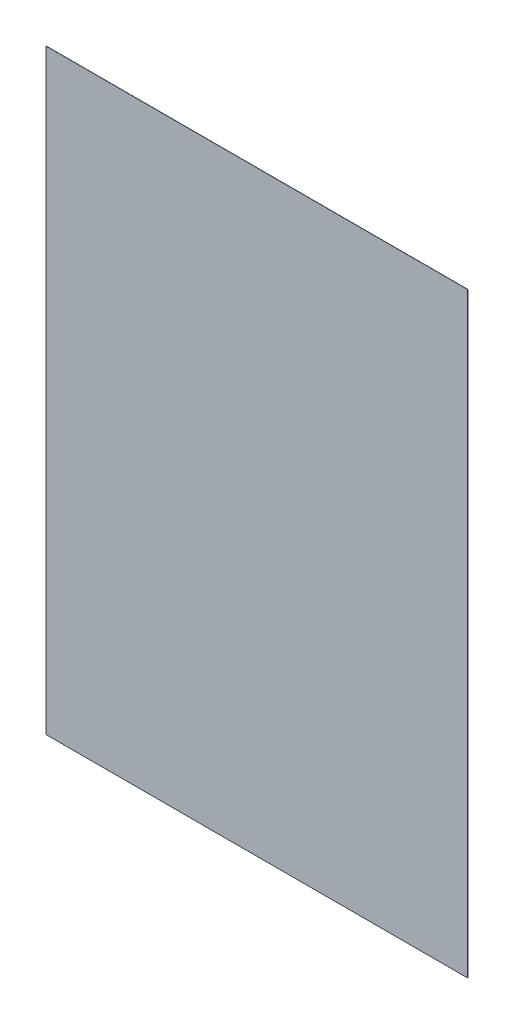
ISO-10303-21;
HEADER;
FILE_DESCRIPTION(('STEP AP214'),'2;1');
FILE_NAME('part.step','',(''),(''),'','','');
FILE_SCHEMA(('AUTOMOTIVE_DESIGN { 1 0 10303 214 1 1 1 1 }'));
ENDSEC;
DATA;
#1=APPLICATION_CONTEXT('core data for automotive mechanical design processes');
#2=APPLICATION_PROTOCOL_DEFINITION('international standard','automotive_design',2000,#1);
#3=PRODUCT_CONTEXT('',#1,'mechanical');
#4=PRODUCT('Part','Part','',(#3));
#5=PRODUCT_RELATED_PRODUCT_CATEGORY('part','',(#4));
#6=PRODUCT_DEFINITION_FORMATION('','',#4);
#7=PRODUCT_DEFINITION_CONTEXT('part definition',#1,'design');
#8=PRODUCT_DEFINITION('design','',#6,#7);
#9=PRODUCT_DEFINITION_SHAPE('','',#8);
#10=(LENGTH_UNIT() NAMED_UNIT(*) SI_UNIT(.MILLI.,.METRE.));
#11=(NAMED_UNIT(*) PLANE_ANGLE_UNIT() SI_UNIT($,.RADIAN.));
#12=(NAMED_UNIT(*) SI_UNIT($,.STERADIAN.) SOLID_ANGLE_UNIT());
#13=UNCERTAINTY_MEASURE_WITH_UNIT(LENGTH_MEASURE(1.E-05),#10,'distance_accuracy_value','');
#14=(GEOMETRIC_REPRESENTATION_CONTEXT(3) GLOBAL_UNCERTAINTY_ASSIGNED_CONTEXT((#13)) GLOBAL_UNIT_ASSIGNED_CONTEXT((#10,
#11,#12)) REPRESENTATION_CONTEXT('',''));
#15=CARTESIAN_POINT('',(0.,0.,0.));
#16=DIRECTION('',(0.,0.,1.));
#17=DIRECTION('',(1.,0.,0.));
#18=AXIS2_PLACEMENT_3D('',#15,#16,#17);
#19=CARTESIAN_POINT('',(0.,0.,0.1));
#20=DIRECTION('',(1.,0.,0.));
#21=DIRECTION('',(0.,1.,0.));
#22=AXIS2_PLACEMENT_3D('',#19,#20,#21);
#23=PLANE('',#22);
#24=DIRECTION('',(0.,-1.,0.));
#25=VECTOR('',#24,1.);
#26=CARTESIAN_POINT('',(0.,0.,0.));
#27=LINE('',#26,#25);
#28=CARTESIAN_POINT('',(0.,297.,0.));
#29=VERTEX_POINT('',#28);
#30=CARTESIAN_POINT('',(0.,0.,0.));
#31=VERTEX_POINT('',#30);
#32=EDGE_CURVE('E101',#29,#31,#27,.T.);
#33=ORIENTED_EDGE('',*,*,#32,.T.);
#34=DIRECTION('',(0.,0.,-1.));
#35=VECTOR('',#34,1.);
#36=CARTESIAN_POINT('',(0.,0.,0.1));
#37=LINE('',#36,#35);
#38=CARTESIAN_POINT('',(0.,0.,0.1));
#39=VERTEX_POINT('',#38);
#40=EDGE_CURVE('E11',#39,#31,#37,.T.);
#41=ORIENTED_EDGE('',*,*,#40,.F.);
#42=DIRECTION('',(0.,-1.,0.));
#43=VECTOR('',#42,1.);
#44=CARTESIAN_POINT('',(0.,0.,0.1));
#45=LINE('',#44,#43);
#46=CARTESIAN_POINT('',(0.,297.,0.1));
#47=VERTEX_POINT('',#46);
#48=EDGE_CURVE('E89',#47,#39,#45,.T.);
#49=ORIENTED_EDGE('',*,*,#48,.F.);
#50=DIRECTION('',(0.,0.,-1.));
#51=VECTOR('',#50,1.);
#52=CARTESIAN_POINT('',(0.,297.,0.1));
#53=LINE('',#52,#51);
#54=EDGE_CURVE('E97',#47,#29,#53,.T.);
#55=ORIENTED_EDGE('',*,*,#54,.T.);
#56=EDGE_LOOP('',(#33,#41,#49,#55));
#57=FACE_BOUND('',#56,.T.);
#58=ADVANCED_FACE('F38',(#57),#23,.F.);
#59=CARTESIAN_POINT('',(0.,0.,0.1));
#60=DIRECTION('',(0.,1.,0.));
#61=DIRECTION('',(0.,0.,1.));
#62=AXIS2_PLACEMENT_3D('',#59,#60,#61);
#63=PLANE('',#62);
#64=DIRECTION('',(1.,0.,0.));
#65=VECTOR('',#64,1.);
#66=CARTESIAN_POINT('',(0.,0.,0.));
#67=LINE('',#66,#65);
#68=CARTESIAN_POINT('',(210.,0.,0.));
#69=VERTEX_POINT('',#68);
#70=EDGE_CURVE('E93',#31,#69,#67,.T.);
#71=ORIENTED_EDGE('',*,*,#70,.T.);
#72=DIRECTION('',(0.,0.,-1.));
#73=VECTOR('',#72,1.);
#74=CARTESIAN_POINT('',(210.,0.,0.1));
#75=LINE('',#74,#73);
#76=CARTESIAN_POINT('',(210.,0.,0.1));
#77=VERTEX_POINT('',#76);
#78=EDGE_CURVE('E46',#77,#69,#75,.T.);
#79=ORIENTED_EDGE('',*,*,#78,.F.);
#80=DIRECTION('',(1.,0.,0.));
#81=VECTOR('',#80,1.);
#82=CARTESIAN_POINT('',(0.,0.,0.1));
#83=LINE('',#82,#81);
#84=EDGE_CURVE('E84',#39,#77,#83,.T.);
#85=ORIENTED_EDGE('',*,*,#84,.F.);
#86=ORIENTED_EDGE('',*,*,#40,.T.);
#87=EDGE_LOOP('',(#71,#79,#85,#86));
#88=FACE_BOUND('',#87,.T.);
#89=ADVANCED_FACE('F92',(#88),#63,.F.);
#90=CARTESIAN_POINT('',(210.,0.,0.1));
#91=DIRECTION('',(-1.,0.,0.));
#92=DIRECTION('',(0.,-1.,0.));
#93=AXIS2_PLACEMENT_3D('',#90,#91,#92);
#94=PLANE('',#93);
#95=DIRECTION('',(0.,1.,0.));
#96=VECTOR('',#95,1.);
#97=CARTESIAN_POINT('',(210.,0.,0.));
#98=LINE('',#97,#96);
#99=CARTESIAN_POINT('',(210.,297.,0.));
#100=VERTEX_POINT('',#99);
#101=EDGE_CURVE('E71',#69,#100,#98,.T.);
#102=ORIENTED_EDGE('',*,*,#101,.T.);
#103=DIRECTION('',(0.,0.,-1.));
#104=VECTOR('',#103,1.);
#105=CARTESIAN_POINT('',(210.,297.,0.1));
#106=LINE('',#105,#104);
#107=CARTESIAN_POINT('',(210.,297.,0.1));
#108=VERTEX_POINT('',#107);
#109=EDGE_CURVE('E94',#108,#100,#106,.T.);
#110=ORIENTED_EDGE('',*,*,#109,.F.);
#111=DIRECTION('',(0.,1.,0.));
#112=VECTOR('',#111,1.);
#113=CARTESIAN_POINT('',(210.,0.,0.1));
#114=LINE('',#113,#112);
#115=EDGE_CURVE('E87',#77,#108,#114,.T.);
#116=ORIENTED_EDGE('',*,*,#115,.F.);
#117=ORIENTED_EDGE('',*,*,#78,.T.);
#118=EDGE_LOOP('',(#102,#110,#116,#117));
#119=FACE_BOUND('',#118,.T.);
#120=ADVANCED_FACE('F95',(#119),#94,.F.);
#121=CARTESIAN_POINT('',(0.,297.,0.1));
#122=DIRECTION('',(0.,-1.,0.));
#123=DIRECTION('',(0.,0.,-1.));
#124=AXIS2_PLACEMENT_3D('',#121,#122,#123);
#125=PLANE('',#124);
#126=DIRECTION('',(-1.,0.,0.));
#127=VECTOR('',#126,1.);
#128=CARTESIAN_POINT('',(0.,297.,0.));
#129=LINE('',#128,#127);
#130=EDGE_CURVE('E77',#100,#29,#129,.T.);
#131=ORIENTED_EDGE('',*,*,#130,.T.);
#132=ORIENTED_EDGE('',*,*,#54,.F.);
#133=DIRECTION('',(-1.,0.,0.));
#134=VECTOR('',#133,1.);
#135=CARTESIAN_POINT('',(0.,297.,0.1));
#136=LINE('',#135,#134);
#137=EDGE_CURVE('E54',#108,#47,#136,.T.);
#138=ORIENTED_EDGE('',*,*,#137,.F.);
#139=ORIENTED_EDGE('',*,*,#109,.T.);
#140=EDGE_LOOP('',(#131,#132,#138,#139));
#141=FACE_BOUND('',#140,.T.);
#142=ADVANCED_FACE('F108',(#141),#125,.F.);
#143=CARTESIAN_POINT('',(0.,0.,0.1));
#144=DIRECTION('',(0.,0.,-1.));
#145=DIRECTION('',(-1.,0.,0.));
#146=AXIS2_PLACEMENT_3D('',#143,#144,#145);
#147=PLANE('',#146);
#148=ORIENTED_EDGE('',*,*,#48,.T.);
#149=ORIENTED_EDGE('',*,*,#84,.T.);
#150=ORIENTED_EDGE('',*,*,#115,.T.);
#151=ORIENTED_EDGE('',*,*,#137,.T.);
#152=EDGE_LOOP('',(#148,#149,#150,#151));
#153=FACE_BOUND('',#152,.T.);
#154=ADVANCED_FACE('F85',(#153),#147,.F.);
#155=CARTESIAN_POINT('',(0.,0.,0.));
#156=DIRECTION('',(0.,0.,-1.));
#157=DIRECTION('',(-1.,0.,0.));
#158=AXIS2_PLACEMENT_3D('',#155,#156,#157);
#159=PLANE('',#158);
#160=ORIENTED_EDGE('',*,*,#32,.F.);
#161=ORIENTED_EDGE('',*,*,#130,.F.);
#162=ORIENTED_EDGE('',*,*,#101,.F.);
#163=ORIENTED_EDGE('',*,*,#70,.F.);
#164=EDGE_LOOP('',(#160,#161,#162,#163));
#165=FACE_BOUND('',#164,.T.);
#166=ADVANCED_FACE('F111',(#165),#159,.T.);
#167=CLOSED_SHELL('',(#58,#89,#120,#142,#154,#166));
#168=MANIFOLD_SOLID_BREP('B2',#167);
#169=ADVANCED_BREP_SHAPE_REPRESENTATION('',(#18,#168),#14);
#170=SHAPE_DEFINITION_REPRESENTATION(#9,#169);
ENDSEC;
END-ISO-10303-21;
